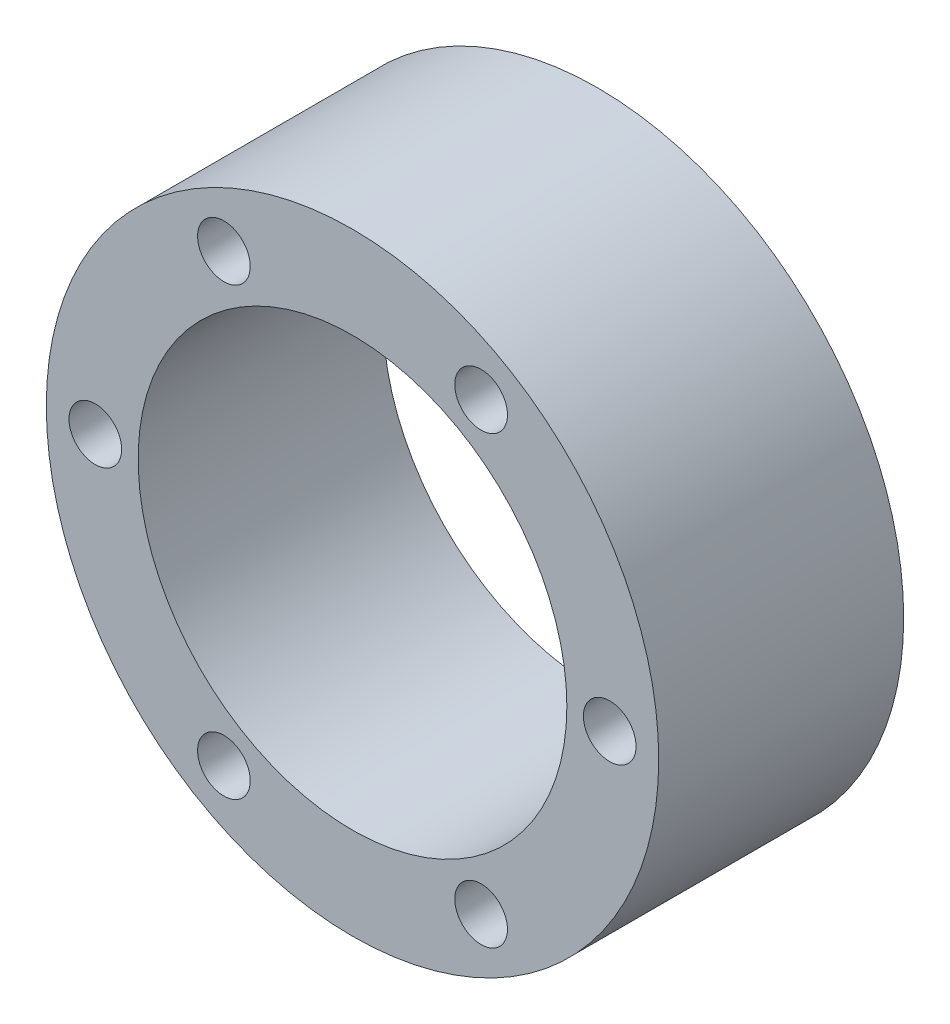
ISO-10303-21;
HEADER;
FILE_DESCRIPTION(('STEP AP214'),'2;1');
FILE_NAME('part.step','',(''),(''),'','','');
FILE_SCHEMA(('AUTOMOTIVE_DESIGN { 1 0 10303 214 1 1 1 1 }'));
ENDSEC;
DATA;
#1=APPLICATION_CONTEXT('core data for automotive mechanical design processes');
#2=APPLICATION_PROTOCOL_DEFINITION('international standard','automotive_design',2000,#1);
#3=PRODUCT_CONTEXT('',#1,'mechanical');
#4=PRODUCT('Part','Part','',(#3));
#5=PRODUCT_RELATED_PRODUCT_CATEGORY('part','',(#4));
#6=PRODUCT_DEFINITION_FORMATION('','',#4);
#7=PRODUCT_DEFINITION_CONTEXT('part definition',#1,'design');
#8=PRODUCT_DEFINITION('design','',#6,#7);
#9=PRODUCT_DEFINITION_SHAPE('','',#8);
#10=(LENGTH_UNIT() NAMED_UNIT(*) SI_UNIT(.MILLI.,.METRE.));
#11=(NAMED_UNIT(*) PLANE_ANGLE_UNIT() SI_UNIT($,.RADIAN.));
#12=(NAMED_UNIT(*) SI_UNIT($,.STERADIAN.) SOLID_ANGLE_UNIT());
#13=UNCERTAINTY_MEASURE_WITH_UNIT(LENGTH_MEASURE(1.E-05),#10,'distance_accuracy_value','');
#14=(GEOMETRIC_REPRESENTATION_CONTEXT(3) GLOBAL_UNCERTAINTY_ASSIGNED_CONTEXT((#13)) GLOBAL_UNIT_ASSIGNED_CONTEXT((#10,
#11,#12)) REPRESENTATION_CONTEXT('',''));
#15=CARTESIAN_POINT('',(0.,0.,0.));
#16=DIRECTION('',(0.,0.,1.));
#17=DIRECTION('',(1.,0.,0.));
#18=AXIS2_PLACEMENT_3D('',#15,#16,#17);
#19=CARTESIAN_POINT('',(0.,0.,20.));
#20=DIRECTION('',(0.,0.,1.));
#21=DIRECTION('',(1.,0.,0.));
#22=AXIS2_PLACEMENT_3D('',#19,#20,#21);
#23=PLANE('',#22);
#24=CARTESIAN_POINT('',(21.,0.,20.));
#25=DIRECTION('',(0.,0.,1.));
#26=DIRECTION('',(1.,0.,0.));
#27=AXIS2_PLACEMENT_3D('',#24,#25,#26);
#28=CIRCLE('',#27,2.14999999999999);
#29=CARTESIAN_POINT('',(23.15,0.,20.));
#30=VERTEX_POINT('',#29);
#31=EDGE_CURVE('E81',#30,#30,#28,.T.);
#32=ORIENTED_EDGE('',*,*,#31,.F.);
#33=EDGE_LOOP('',(#32));
#34=FACE_BOUND('',#33,.T.);
#35=CARTESIAN_POINT('',(10.5,-18.1865334794732,20.));
#36=DIRECTION('',(0.,0.,1.));
#37=DIRECTION('',(1.,0.,0.));
#38=AXIS2_PLACEMENT_3D('',#35,#36,#37);
#39=CIRCLE('',#38,2.14999999999999);
#40=CARTESIAN_POINT('',(12.65,-18.1865334794732,20.));
#41=VERTEX_POINT('',#40);
#42=EDGE_CURVE('E75',#41,#41,#39,.T.);
#43=ORIENTED_EDGE('',*,*,#42,.F.);
#44=EDGE_LOOP('',(#43));
#45=FACE_BOUND('',#44,.T.);
#46=CARTESIAN_POINT('',(-10.5,-18.1865334794732,20.));
#47=DIRECTION('',(0.,0.,1.));
#48=DIRECTION('',(1.,0.,0.));
#49=AXIS2_PLACEMENT_3D('',#46,#47,#48);
#50=CIRCLE('',#49,2.14999999999999);
#51=CARTESIAN_POINT('',(-8.35000000000001,-18.1865334794732,20.));
#52=VERTEX_POINT('',#51);
#53=EDGE_CURVE('E69',#52,#52,#50,.T.);
#54=ORIENTED_EDGE('',*,*,#53,.F.);
#55=EDGE_LOOP('',(#54));
#56=FACE_BOUND('',#55,.T.);
#57=CARTESIAN_POINT('',(-21.,0.,20.));
#58=DIRECTION('',(0.,0.,1.));
#59=DIRECTION('',(1.,0.,0.));
#60=AXIS2_PLACEMENT_3D('',#57,#58,#59);
#61=CIRCLE('',#60,2.14999999999999);
#62=CARTESIAN_POINT('',(-18.85,0.,20.));
#63=VERTEX_POINT('',#62);
#64=EDGE_CURVE('E63',#63,#63,#61,.T.);
#65=ORIENTED_EDGE('',*,*,#64,.F.);
#66=EDGE_LOOP('',(#65));
#67=FACE_BOUND('',#66,.T.);
#68=CARTESIAN_POINT('',(-10.5,18.1865334794732,20.));
#69=DIRECTION('',(0.,0.,1.));
#70=DIRECTION('',(1.,0.,0.));
#71=AXIS2_PLACEMENT_3D('',#68,#69,#70);
#72=CIRCLE('',#71,2.14999999999999);
#73=CARTESIAN_POINT('',(-8.35000000000002,18.1865334794732,20.));
#74=VERTEX_POINT('',#73);
#75=EDGE_CURVE('E57',#74,#74,#72,.T.);
#76=ORIENTED_EDGE('',*,*,#75,.F.);
#77=EDGE_LOOP('',(#76));
#78=FACE_BOUND('',#77,.T.);
#79=CARTESIAN_POINT('',(10.5,18.1865334794732,20.));
#80=DIRECTION('',(0.,0.,1.));
#81=DIRECTION('',(1.,0.,0.));
#82=AXIS2_PLACEMENT_3D('',#79,#80,#81);
#83=CIRCLE('',#82,2.14999999999999);
#84=CARTESIAN_POINT('',(12.65,18.1865334794732,20.));
#85=VERTEX_POINT('',#84);
#86=EDGE_CURVE('E51',#85,#85,#83,.T.);
#87=ORIENTED_EDGE('',*,*,#86,.F.);
#88=EDGE_LOOP('',(#87));
#89=FACE_BOUND('',#88,.T.);
#90=CARTESIAN_POINT('',(0.,0.,20.));
#91=DIRECTION('',(0.,0.,1.));
#92=DIRECTION('',(1.,0.,0.));
#93=AXIS2_PLACEMENT_3D('',#90,#91,#92);
#94=CIRCLE('',#93,25.);
#95=CARTESIAN_POINT('',(25.,0.,20.));
#96=VERTEX_POINT('',#95);
#97=EDGE_CURVE('E10',#96,#96,#94,.T.);
#98=ORIENTED_EDGE('',*,*,#97,.T.);
#99=EDGE_LOOP('',(#98));
#100=FACE_BOUND('',#99,.T.);
#101=CARTESIAN_POINT('',(0.,0.,20.));
#102=DIRECTION('',(0.,0.,1.));
#103=DIRECTION('',(1.,0.,0.));
#104=AXIS2_PLACEMENT_3D('',#101,#102,#103);
#105=CIRCLE('',#104,17.5);
#106=CARTESIAN_POINT('',(17.5,0.,20.));
#107=VERTEX_POINT('',#106);
#108=EDGE_CURVE('E41',#107,#107,#105,.T.);
#109=ORIENTED_EDGE('',*,*,#108,.F.);
#110=EDGE_LOOP('',(#109));
#111=FACE_BOUND('',#110,.T.);
#112=ADVANCED_FACE('F30',(#34,#45,#56,#67,#78,#89,#100,#111),#23,.T.);
#113=CARTESIAN_POINT('',(0.,0.,0.));
#114=DIRECTION('',(0.,0.,1.));
#115=DIRECTION('',(1.,0.,0.));
#116=AXIS2_PLACEMENT_3D('',#113,#114,#115);
#117=PLANE('',#116);
#118=CARTESIAN_POINT('',(21.,0.,0.));
#119=DIRECTION('',(0.,0.,1.));
#120=DIRECTION('',(1.,0.,0.));
#121=AXIS2_PLACEMENT_3D('',#118,#119,#120);
#122=CIRCLE('',#121,2.15);
#123=CARTESIAN_POINT('',(23.15,0.,0.));
#124=VERTEX_POINT('',#123);
#125=EDGE_CURVE('E78',#124,#124,#122,.T.);
#126=ORIENTED_EDGE('',*,*,#125,.T.);
#127=EDGE_LOOP('',(#126));
#128=FACE_BOUND('',#127,.T.);
#129=CARTESIAN_POINT('',(10.5,-18.1865334794732,0.));
#130=DIRECTION('',(0.,0.,1.));
#131=DIRECTION('',(1.,0.,0.));
#132=AXIS2_PLACEMENT_3D('',#129,#130,#131);
#133=CIRCLE('',#132,2.15);
#134=CARTESIAN_POINT('',(12.65,-18.1865334794732,0.));
#135=VERTEX_POINT('',#134);
#136=EDGE_CURVE('E72',#135,#135,#133,.T.);
#137=ORIENTED_EDGE('',*,*,#136,.T.);
#138=EDGE_LOOP('',(#137));
#139=FACE_BOUND('',#138,.T.);
#140=CARTESIAN_POINT('',(-10.5,-18.1865334794732,0.));
#141=DIRECTION('',(0.,0.,1.));
#142=DIRECTION('',(1.,0.,0.));
#143=AXIS2_PLACEMENT_3D('',#140,#141,#142);
#144=CIRCLE('',#143,2.15);
#145=CARTESIAN_POINT('',(-8.35,-18.1865334794732,0.));
#146=VERTEX_POINT('',#145);
#147=EDGE_CURVE('E66',#146,#146,#144,.T.);
#148=ORIENTED_EDGE('',*,*,#147,.T.);
#149=EDGE_LOOP('',(#148));
#150=FACE_BOUND('',#149,.T.);
#151=CARTESIAN_POINT('',(-21.,0.,0.));
#152=DIRECTION('',(0.,0.,1.));
#153=DIRECTION('',(1.,0.,0.));
#154=AXIS2_PLACEMENT_3D('',#151,#152,#153);
#155=CIRCLE('',#154,2.15);
#156=CARTESIAN_POINT('',(-18.85,0.,0.));
#157=VERTEX_POINT('',#156);
#158=EDGE_CURVE('E60',#157,#157,#155,.T.);
#159=ORIENTED_EDGE('',*,*,#158,.T.);
#160=EDGE_LOOP('',(#159));
#161=FACE_BOUND('',#160,.T.);
#162=CARTESIAN_POINT('',(-10.5,18.1865334794732,0.));
#163=DIRECTION('',(0.,0.,1.));
#164=DIRECTION('',(1.,0.,0.));
#165=AXIS2_PLACEMENT_3D('',#162,#163,#164);
#166=CIRCLE('',#165,2.15);
#167=CARTESIAN_POINT('',(-8.35000000000001,18.1865334794732,0.));
#168=VERTEX_POINT('',#167);
#169=EDGE_CURVE('E54',#168,#168,#166,.T.);
#170=ORIENTED_EDGE('',*,*,#169,.T.);
#171=EDGE_LOOP('',(#170));
#172=FACE_BOUND('',#171,.T.);
#173=CARTESIAN_POINT('',(10.5,18.1865334794732,0.));
#174=DIRECTION('',(0.,0.,1.));
#175=DIRECTION('',(1.,0.,0.));
#176=AXIS2_PLACEMENT_3D('',#173,#174,#175);
#177=CIRCLE('',#176,2.15);
#178=CARTESIAN_POINT('',(12.65,18.1865334794732,0.));
#179=VERTEX_POINT('',#178);
#180=EDGE_CURVE('E46',#179,#179,#177,.T.);
#181=ORIENTED_EDGE('',*,*,#180,.T.);
#182=EDGE_LOOP('',(#181));
#183=FACE_BOUND('',#182,.T.);
#184=CARTESIAN_POINT('',(0.,0.,0.));
#185=DIRECTION('',(0.,0.,1.));
#186=DIRECTION('',(1.,0.,0.));
#187=AXIS2_PLACEMENT_3D('',#184,#185,#186);
#188=CIRCLE('',#187,25.);
#189=CARTESIAN_POINT('',(25.,0.,0.));
#190=VERTEX_POINT('',#189);
#191=EDGE_CURVE('E34',#190,#190,#188,.T.);
#192=ORIENTED_EDGE('',*,*,#191,.F.);
#193=EDGE_LOOP('',(#192));
#194=FACE_BOUND('',#193,.T.);
#195=CARTESIAN_POINT('',(0.,0.,0.));
#196=DIRECTION('',(0.,0.,1.));
#197=DIRECTION('',(1.,0.,0.));
#198=AXIS2_PLACEMENT_3D('',#195,#196,#197);
#199=CIRCLE('',#198,17.5);
#200=CARTESIAN_POINT('',(17.5,0.,0.));
#201=VERTEX_POINT('',#200);
#202=EDGE_CURVE('E43',#201,#201,#199,.T.);
#203=ORIENTED_EDGE('',*,*,#202,.T.);
#204=EDGE_LOOP('',(#203));
#205=FACE_BOUND('',#204,.T.);
#206=ADVANCED_FACE('F89',(#128,#139,#150,#161,#172,#183,#194,#205),#117,.F.);
#207=CARTESIAN_POINT('',(0.,0.,20.));
#208=DIRECTION('',(0.,0.,-1.));
#209=DIRECTION('',(-1.,0.,0.));
#210=AXIS2_PLACEMENT_3D('',#207,#208,#209);
#211=CYLINDRICAL_SURFACE('',#210,25.);
#212=ORIENTED_EDGE('',*,*,#97,.F.);
#213=EDGE_LOOP('',(#212));
#214=FACE_BOUND('',#213,.T.);
#215=ORIENTED_EDGE('',*,*,#191,.T.);
#216=EDGE_LOOP('',(#215));
#217=FACE_BOUND('',#216,.T.);
#218=ADVANCED_FACE('F32',(#214,#217),#211,.T.);
#219=CARTESIAN_POINT('',(0.,0.,20.));
#220=DIRECTION('',(0.,0.,-1.));
#221=DIRECTION('',(-1.,0.,0.));
#222=AXIS2_PLACEMENT_3D('',#219,#220,#221);
#223=CYLINDRICAL_SURFACE('',#222,17.5);
#224=ORIENTED_EDGE('',*,*,#108,.T.);
#225=EDGE_LOOP('',(#224));
#226=FACE_BOUND('',#225,.T.);
#227=ORIENTED_EDGE('',*,*,#202,.F.);
#228=EDGE_LOOP('',(#227));
#229=FACE_BOUND('',#228,.T.);
#230=ADVANCED_FACE('F103',(#226,#229),#223,.F.);
#231=CARTESIAN_POINT('',(10.5,18.1865334794732,20.));
#232=DIRECTION('',(0.,0.,1.));
#233=DIRECTION('',(1.,0.,0.));
#234=AXIS2_PLACEMENT_3D('',#231,#232,#233);
#235=CYLINDRICAL_SURFACE('',#234,2.14999999999999);
#236=ORIENTED_EDGE('',*,*,#180,.F.);
#237=EDGE_LOOP('',(#236));
#238=FACE_BOUND('',#237,.T.);
#239=ORIENTED_EDGE('',*,*,#86,.T.);
#240=EDGE_LOOP('',(#239));
#241=FACE_BOUND('',#240,.T.);
#242=ADVANCED_FACE('F106',(#238,#241),#235,.F.);
#243=CARTESIAN_POINT('',(-10.5,18.1865334794732,20.));
#244=DIRECTION('',(0.,0.,1.));
#245=DIRECTION('',(1.,0.,0.));
#246=AXIS2_PLACEMENT_3D('',#243,#244,#245);
#247=CYLINDRICAL_SURFACE('',#246,2.14999999999999);
#248=ORIENTED_EDGE('',*,*,#169,.F.);
#249=EDGE_LOOP('',(#248));
#250=FACE_BOUND('',#249,.T.);
#251=ORIENTED_EDGE('',*,*,#75,.T.);
#252=EDGE_LOOP('',(#251));
#253=FACE_BOUND('',#252,.T.);
#254=ADVANCED_FACE('F120',(#250,#253),#247,.F.);
#255=CARTESIAN_POINT('',(-21.,0.,20.));
#256=DIRECTION('',(0.,0.,1.));
#257=DIRECTION('',(1.,0.,0.));
#258=AXIS2_PLACEMENT_3D('',#255,#256,#257);
#259=CYLINDRICAL_SURFACE('',#258,2.14999999999999);
#260=ORIENTED_EDGE('',*,*,#158,.F.);
#261=EDGE_LOOP('',(#260));
#262=FACE_BOUND('',#261,.T.);
#263=ORIENTED_EDGE('',*,*,#64,.T.);
#264=EDGE_LOOP('',(#263));
#265=FACE_BOUND('',#264,.T.);
#266=ADVANCED_FACE('F124',(#262,#265),#259,.F.);
#267=CARTESIAN_POINT('',(-10.5,-18.1865334794732,20.));
#268=DIRECTION('',(0.,0.,1.));
#269=DIRECTION('',(1.,0.,0.));
#270=AXIS2_PLACEMENT_3D('',#267,#268,#269);
#271=CYLINDRICAL_SURFACE('',#270,2.14999999999999);
#272=ORIENTED_EDGE('',*,*,#147,.F.);
#273=EDGE_LOOP('',(#272));
#274=FACE_BOUND('',#273,.T.);
#275=ORIENTED_EDGE('',*,*,#53,.T.);
#276=EDGE_LOOP('',(#275));
#277=FACE_BOUND('',#276,.T.);
#278=ADVANCED_FACE('F128',(#274,#277),#271,.F.);
#279=CARTESIAN_POINT('',(10.5,-18.1865334794732,20.));
#280=DIRECTION('',(0.,0.,1.));
#281=DIRECTION('',(1.,0.,0.));
#282=AXIS2_PLACEMENT_3D('',#279,#280,#281);
#283=CYLINDRICAL_SURFACE('',#282,2.14999999999999);
#284=ORIENTED_EDGE('',*,*,#136,.F.);
#285=EDGE_LOOP('',(#284));
#286=FACE_BOUND('',#285,.T.);
#287=ORIENTED_EDGE('',*,*,#42,.T.);
#288=EDGE_LOOP('',(#287));
#289=FACE_BOUND('',#288,.T.);
#290=ADVANCED_FACE('F132',(#286,#289),#283,.F.);
#291=CARTESIAN_POINT('',(21.,0.,20.));
#292=DIRECTION('',(0.,0.,1.));
#293=DIRECTION('',(1.,0.,0.));
#294=AXIS2_PLACEMENT_3D('',#291,#292,#293);
#295=CYLINDRICAL_SURFACE('',#294,2.14999999999999);
#296=ORIENTED_EDGE('',*,*,#125,.F.);
#297=EDGE_LOOP('',(#296));
#298=FACE_BOUND('',#297,.T.);
#299=ORIENTED_EDGE('',*,*,#31,.T.);
#300=EDGE_LOOP('',(#299));
#301=FACE_BOUND('',#300,.T.);
#302=ADVANCED_FACE('F85',(#298,#301),#295,.F.);
#303=CLOSED_SHELL('',(#112,#206,#218,#230,#242,#254,#266,#278,#290,#302));
#304=MANIFOLD_SOLID_BREP('B2',#303);
#305=ADVANCED_BREP_SHAPE_REPRESENTATION('',(#18,#304),#14);
#306=SHAPE_DEFINITION_REPRESENTATION(#9,#305);
ENDSEC;
END-ISO-10303-21;
